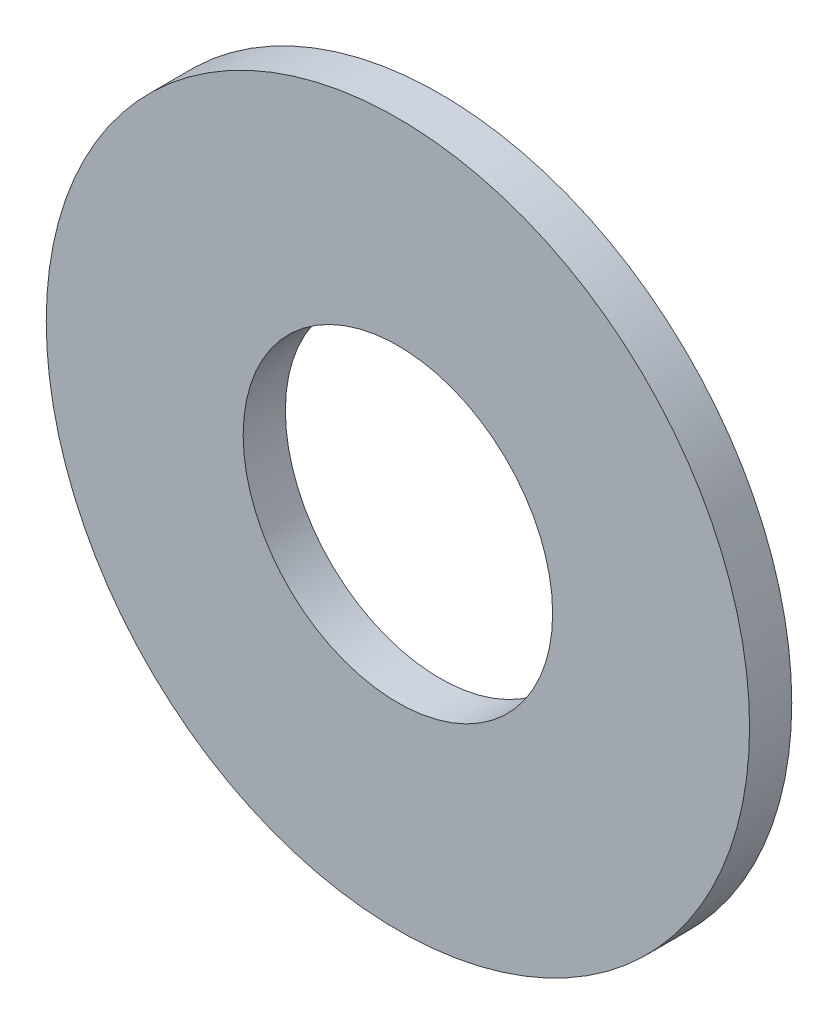
ISO-10303-21;
HEADER;
FILE_DESCRIPTION(('STEP AP214'),'2;1');
FILE_NAME('part.step','',(''),(''),'','','');
FILE_SCHEMA(('AUTOMOTIVE_DESIGN { 1 0 10303 214 1 1 1 1 }'));
ENDSEC;
DATA;
#1=APPLICATION_CONTEXT('core data for automotive mechanical design processes');
#2=APPLICATION_PROTOCOL_DEFINITION('international standard','automotive_design',2000,#1);
#3=PRODUCT_CONTEXT('',#1,'mechanical');
#4=PRODUCT('Part','Part','',(#3));
#5=PRODUCT_RELATED_PRODUCT_CATEGORY('part','',(#4));
#6=PRODUCT_DEFINITION_FORMATION('','',#4);
#7=PRODUCT_DEFINITION_CONTEXT('part definition',#1,'design');
#8=PRODUCT_DEFINITION('design','',#6,#7);
#9=PRODUCT_DEFINITION_SHAPE('','',#8);
#10=(LENGTH_UNIT() NAMED_UNIT(*) SI_UNIT(.MILLI.,.METRE.));
#11=(NAMED_UNIT(*) PLANE_ANGLE_UNIT() SI_UNIT($,.RADIAN.));
#12=(NAMED_UNIT(*) SI_UNIT($,.STERADIAN.) SOLID_ANGLE_UNIT());
#13=UNCERTAINTY_MEASURE_WITH_UNIT(LENGTH_MEASURE(1.E-05),#10,'distance_accuracy_value','');
#14=(GEOMETRIC_REPRESENTATION_CONTEXT(3) GLOBAL_UNCERTAINTY_ASSIGNED_CONTEXT((#13)) GLOBAL_UNIT_ASSIGNED_CONTEXT((#10,
#11,#12)) REPRESENTATION_CONTEXT('',''));
#15=CARTESIAN_POINT('',(0.,0.,0.));
#16=DIRECTION('',(0.,0.,1.));
#17=DIRECTION('',(1.,0.,0.));
#18=AXIS2_PLACEMENT_3D('',#15,#16,#17);
#19=CARTESIAN_POINT('',(0.,0.,0.3));
#20=DIRECTION('',(0.,0.,1.));
#21=DIRECTION('',(1.,0.,0.));
#22=AXIS2_PLACEMENT_3D('',#19,#20,#21);
#23=PLANE('',#22);
#24=CARTESIAN_POINT('',(0.,0.,0.3));
#25=DIRECTION('',(0.,0.,1.));
#26=DIRECTION('',(1.,0.,0.));
#27=AXIS2_PLACEMENT_3D('',#24,#25,#26);
#28=CIRCLE('',#27,2.5);
#29=CARTESIAN_POINT('',(2.5,0.,0.3));
#30=VERTEX_POINT('',#29);
#31=EDGE_CURVE('E10',#30,#30,#28,.T.);
#32=ORIENTED_EDGE('',*,*,#31,.T.);
#33=EDGE_LOOP('',(#32));
#34=FACE_BOUND('',#33,.T.);
#35=CARTESIAN_POINT('',(0.,0.,0.3));
#36=DIRECTION('',(0.,0.,1.));
#37=DIRECTION('',(1.,0.,0.));
#38=AXIS2_PLACEMENT_3D('',#35,#36,#37);
#39=CIRCLE('',#38,1.1);
#40=CARTESIAN_POINT('',(1.1,0.,0.3));
#41=VERTEX_POINT('',#40);
#42=EDGE_CURVE('E42',#41,#41,#39,.T.);
#43=ORIENTED_EDGE('',*,*,#42,.F.);
#44=EDGE_LOOP('',(#43));
#45=FACE_BOUND('',#44,.T.);
#46=ADVANCED_FACE('F31',(#34,#45),#23,.T.);
#47=CARTESIAN_POINT('',(0.,0.,0.));
#48=DIRECTION('',(0.,0.,1.));
#49=DIRECTION('',(1.,0.,0.));
#50=AXIS2_PLACEMENT_3D('',#47,#48,#49);
#51=PLANE('',#50);
#52=CARTESIAN_POINT('',(0.,0.,0.));
#53=DIRECTION('',(0.,0.,1.));
#54=DIRECTION('',(1.,0.,0.));
#55=AXIS2_PLACEMENT_3D('',#52,#53,#54);
#56=CIRCLE('',#55,2.5);
#57=CARTESIAN_POINT('',(2.5,0.,0.));
#58=VERTEX_POINT('',#57);
#59=EDGE_CURVE('E35',#58,#58,#56,.T.);
#60=ORIENTED_EDGE('',*,*,#59,.F.);
#61=EDGE_LOOP('',(#60));
#62=FACE_BOUND('',#61,.T.);
#63=CARTESIAN_POINT('',(0.,0.,0.));
#64=DIRECTION('',(0.,0.,1.));
#65=DIRECTION('',(1.,0.,0.));
#66=AXIS2_PLACEMENT_3D('',#63,#64,#65);
#67=CIRCLE('',#66,1.1);
#68=CARTESIAN_POINT('',(1.1,0.,0.));
#69=VERTEX_POINT('',#68);
#70=EDGE_CURVE('E44',#69,#69,#67,.T.);
#71=ORIENTED_EDGE('',*,*,#70,.T.);
#72=EDGE_LOOP('',(#71));
#73=FACE_BOUND('',#72,.T.);
#74=ADVANCED_FACE('F54',(#62,#73),#51,.F.);
#75=CARTESIAN_POINT('',(0.,0.,0.3));
#76=DIRECTION('',(0.,0.,-1.));
#77=DIRECTION('',(-1.,0.,0.));
#78=AXIS2_PLACEMENT_3D('',#75,#76,#77);
#79=CYLINDRICAL_SURFACE('',#78,2.5);
#80=ORIENTED_EDGE('',*,*,#31,.F.);
#81=EDGE_LOOP('',(#80));
#82=FACE_BOUND('',#81,.T.);
#83=ORIENTED_EDGE('',*,*,#59,.T.);
#84=EDGE_LOOP('',(#83));
#85=FACE_BOUND('',#84,.T.);
#86=ADVANCED_FACE('F33',(#82,#85),#79,.T.);
#87=CARTESIAN_POINT('',(0.,0.,0.3));
#88=DIRECTION('',(0.,0.,-1.));
#89=DIRECTION('',(-1.,0.,0.));
#90=AXIS2_PLACEMENT_3D('',#87,#88,#89);
#91=CYLINDRICAL_SURFACE('',#90,1.1);
#92=ORIENTED_EDGE('',*,*,#42,.T.);
#93=EDGE_LOOP('',(#92));
#94=FACE_BOUND('',#93,.T.);
#95=ORIENTED_EDGE('',*,*,#70,.F.);
#96=EDGE_LOOP('',(#95));
#97=FACE_BOUND('',#96,.T.);
#98=ADVANCED_FACE('F50',(#94,#97),#91,.F.);
#99=CLOSED_SHELL('',(#46,#74,#86,#98));
#100=MANIFOLD_SOLID_BREP('B2',#99);
#101=ADVANCED_BREP_SHAPE_REPRESENTATION('',(#18,#100),#14);
#102=SHAPE_DEFINITION_REPRESENTATION(#9,#101);
ENDSEC;
END-ISO-10303-21;
